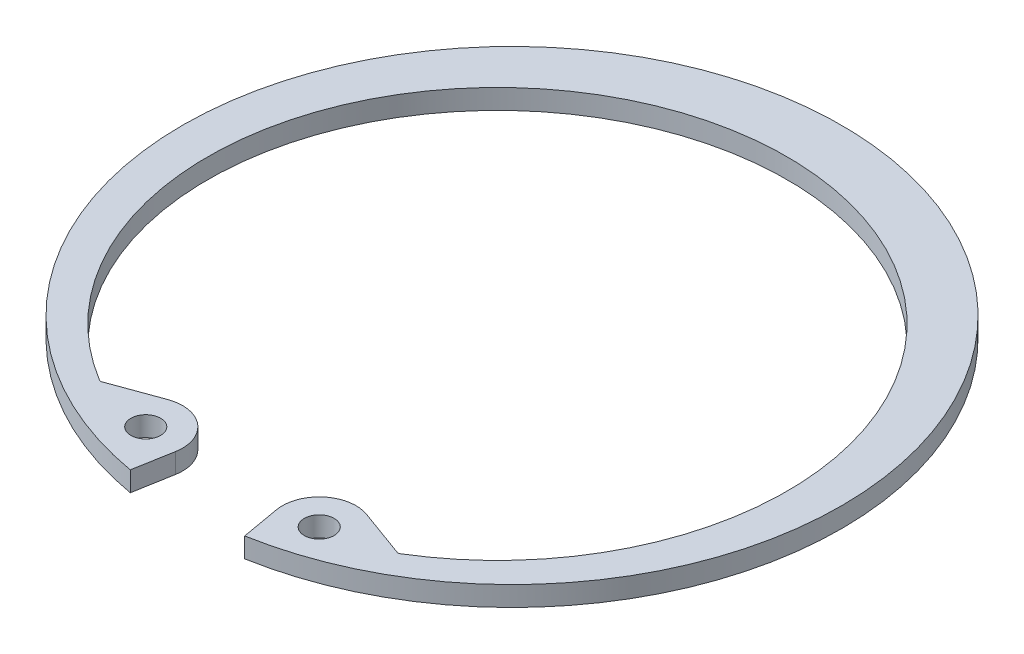
ISO-10303-21;
HEADER;
FILE_DESCRIPTION(('STEP AP214'),'2;1');
FILE_NAME('part.step','',(''),(''),'','','');
FILE_SCHEMA(('AUTOMOTIVE_DESIGN { 1 0 10303 214 1 1 1 1 }'));
ENDSEC;
DATA;
#1=APPLICATION_CONTEXT('core data for automotive mechanical design processes');
#2=APPLICATION_PROTOCOL_DEFINITION('international standard','automotive_design',2000,#1);
#3=PRODUCT_CONTEXT('',#1,'mechanical');
#4=PRODUCT('Part','Part','',(#3));
#5=PRODUCT_RELATED_PRODUCT_CATEGORY('part','',(#4));
#6=PRODUCT_DEFINITION_FORMATION('','',#4);
#7=PRODUCT_DEFINITION_CONTEXT('part definition',#1,'design');
#8=PRODUCT_DEFINITION('design','',#6,#7);
#9=PRODUCT_DEFINITION_SHAPE('','',#8);
#10=(LENGTH_UNIT() NAMED_UNIT(*) SI_UNIT(.MILLI.,.METRE.));
#11=(NAMED_UNIT(*) PLANE_ANGLE_UNIT() SI_UNIT($,.RADIAN.));
#12=(NAMED_UNIT(*) SI_UNIT($,.STERADIAN.) SOLID_ANGLE_UNIT());
#13=UNCERTAINTY_MEASURE_WITH_UNIT(LENGTH_MEASURE(1.E-05),#10,'distance_accuracy_value','');
#14=(GEOMETRIC_REPRESENTATION_CONTEXT(3) GLOBAL_UNCERTAINTY_ASSIGNED_CONTEXT((#13)) GLOBAL_UNIT_ASSIGNED_CONTEXT((#10,
#11,#12)) REPRESENTATION_CONTEXT('',''));
#15=CARTESIAN_POINT('',(0.,0.,0.));
#16=DIRECTION('',(0.,0.,1.));
#17=DIRECTION('',(1.,0.,0.));
#18=AXIS2_PLACEMENT_3D('',#15,#16,#17);
#19=CARTESIAN_POINT('',(6.87148699334858,-1.5748,22.1487706778557));
#20=DIRECTION('',(0.,1.,0.));
#21=DIRECTION('',(0.,0.,1.));
#22=AXIS2_PLACEMENT_3D('',#19,#20,#21);
#23=CYLINDRICAL_SURFACE('',#22,2.921);
#24=CARTESIAN_POINT('',(6.87148699334858,0.,22.1487706778557));
#25=DIRECTION('',(0.,1.,0.));
#26=DIRECTION('',(0.,0.,-1.));
#27=AXIS2_PLACEMENT_3D('',#24,#25,#26);
#28=CIRCLE('',#27,2.921);
#29=CARTESIAN_POINT('',(7.87052783200287,0.,19.4039285325401));
#30=VERTEX_POINT('',#29);
#31=CARTESIAN_POINT('',(3.99486354679992,0.,22.6559970048208));
#32=VERTEX_POINT('',#31);
#33=EDGE_CURVE('E207',#30,#32,#28,.T.);
#34=ORIENTED_EDGE('',*,*,#33,.F.);
#35=DIRECTION('',(0.,1.,0.));
#36=VECTOR('',#35,1.);
#37=CARTESIAN_POINT('',(7.87052783200287,-1.5748,19.4039285325401));
#38=LINE('',#37,#36);
#39=CARTESIAN_POINT('',(7.87052783200287,-1.5748,19.4039285325401));
#40=VERTEX_POINT('',#39);
#41=EDGE_CURVE('E175',#40,#30,#38,.T.);
#42=ORIENTED_EDGE('',*,*,#41,.F.);
#43=CARTESIAN_POINT('',(6.87148699334858,-1.5748,22.1487706778557));
#44=DIRECTION('',(0.,1.,0.));
#45=DIRECTION('',(0.,0.,-1.));
#46=AXIS2_PLACEMENT_3D('',#43,#44,#45);
#47=CIRCLE('',#46,2.921);
#48=CARTESIAN_POINT('',(3.99486354679992,-1.5748,22.6559970048208));
#49=VERTEX_POINT('',#48);
#50=EDGE_CURVE('E167',#40,#49,#47,.T.);
#51=ORIENTED_EDGE('',*,*,#50,.T.);
#52=DIRECTION('',(0.,1.,0.));
#53=VECTOR('',#52,1.);
#54=CARTESIAN_POINT('',(3.99486354679992,-1.5748,22.6559970048208));
#55=LINE('',#54,#53);
#56=EDGE_CURVE('E149',#49,#32,#55,.T.);
#57=ORIENTED_EDGE('',*,*,#56,.T.);
#58=EDGE_LOOP('',(#34,#42,#51,#57));
#59=FACE_BOUND('',#58,.T.);
#60=ADVANCED_FACE('F53',(#59),#23,.T.);
#61=CARTESIAN_POINT('',(11.8104832615939,-1.5748,20.8379550332467));
#62=DIRECTION('',(0.342020143325673,0.,-0.939692620785907));
#63=DIRECTION('',(-0.939692620785907,0.,-0.342020143325673));
#64=AXIS2_PLACEMENT_3D('',#61,#62,#63);
#65=PLANE('',#64);
#66=DIRECTION('',(-0.939692620785907,0.,-0.342020143325673));
#67=VECTOR('',#66,1.);
#68=CARTESIAN_POINT('',(11.8104832615939,0.,20.8379550332467));
#69=LINE('',#68,#67);
#70=CARTESIAN_POINT('',(11.6963266448967,0.,20.7964054227244));
#71=VERTEX_POINT('',#70);
#72=EDGE_CURVE('E177',#71,#30,#69,.T.);
#73=ORIENTED_EDGE('',*,*,#72,.F.);
#74=DIRECTION('',(0.,-1.,0.));
#75=VECTOR('',#74,1.);
#76=CARTESIAN_POINT('',(11.6963266448967,-1.5748,20.7964054227244));
#77=LINE('',#76,#75);
#78=CARTESIAN_POINT('',(11.6963266448967,-1.5748,20.7964054227244));
#79=VERTEX_POINT('',#78);
#80=EDGE_CURVE('E72',#71,#79,#77,.T.);
#81=ORIENTED_EDGE('',*,*,#80,.T.);
#82=DIRECTION('',(-0.939692620785907,0.,-0.342020143325673));
#83=VECTOR('',#82,1.);
#84=CARTESIAN_POINT('',(11.8104832615939,-1.5748,20.8379550332467));
#85=LINE('',#84,#83);
#86=EDGE_CURVE('E161',#79,#40,#85,.T.);
#87=ORIENTED_EDGE('',*,*,#86,.T.);
#88=ORIENTED_EDGE('',*,*,#41,.T.);
#89=EDGE_LOOP('',(#73,#81,#87,#88));
#90=FACE_BOUND('',#89,.T.);
#91=ADVANCED_FACE('F292',(#90),#65,.T.);
#92=CARTESIAN_POINT('',(0.,-1.5748,1.15835846487126));
#93=DIRECTION('',(0.,1.,0.));
#94=DIRECTION('',(0.,0.,1.));
#95=AXIS2_PLACEMENT_3D('',#92,#93,#94);
#96=CYLINDRICAL_SURFACE('',#95,22.9515584648713);
#97=CARTESIAN_POINT('',(0.,0.,1.15835846487126));
#98=DIRECTION('',(0.,-1.,0.));
#99=DIRECTION('',(0.,0.,1.));
#100=AXIS2_PLACEMENT_3D('',#97,#98,#99);
#101=CIRCLE('',#100,22.9515584648713);
#102=CARTESIAN_POINT('',(-11.9150612011123,0.,20.7748146315735));
#103=VERTEX_POINT('',#102);
#104=CARTESIAN_POINT('',(11.9150612011123,0.,20.7748146315736));
#105=VERTEX_POINT('',#104);
#106=EDGE_CURVE('E182',#103,#105,#101,.T.);
#107=ORIENTED_EDGE('',*,*,#106,.F.);
#108=DIRECTION('',(0.,1.,0.));
#109=VECTOR('',#108,1.);
#110=CARTESIAN_POINT('',(-11.9150612011123,-1.5748,20.7748146315735));
#111=LINE('',#110,#109);
#112=CARTESIAN_POINT('',(-11.9150612011123,-1.5748,20.7748146315735));
#113=VERTEX_POINT('',#112);
#114=EDGE_CURVE('E252',#103,#113,#111,.F.);
#115=ORIENTED_EDGE('',*,*,#114,.T.);
#116=CARTESIAN_POINT('',(0.,-1.5748,1.15835846487126));
#117=DIRECTION('',(0.,-1.,0.));
#118=DIRECTION('',(0.,0.,1.));
#119=AXIS2_PLACEMENT_3D('',#116,#117,#118);
#120=CIRCLE('',#119,22.9515584648713);
#121=CARTESIAN_POINT('',(11.9150612011123,-1.5748,20.7748146315736));
#122=VERTEX_POINT('',#121);
#123=EDGE_CURVE('E202',#113,#122,#120,.T.);
#124=ORIENTED_EDGE('',*,*,#123,.T.);
#125=DIRECTION('',(0.,1.,0.));
#126=VECTOR('',#125,1.);
#127=CARTESIAN_POINT('',(11.9150612011123,-1.5748,20.7748146315736));
#128=LINE('',#127,#126);
#129=EDGE_CURVE('E248',#122,#105,#128,.T.);
#130=ORIENTED_EDGE('',*,*,#129,.T.);
#131=EDGE_LOOP('',(#107,#115,#124,#130));
#132=FACE_BOUND('',#131,.T.);
#133=ADVANCED_FACE('F299',(#132),#96,.F.);
#134=CARTESIAN_POINT('',(-11.8104832615939,-1.5748,20.8379550332467));
#135=DIRECTION('',(-0.342020143325667,0.,-0.939692620785909));
#136=DIRECTION('',(-0.939692620785909,0.,0.342020143325667));
#137=AXIS2_PLACEMENT_3D('',#134,#135,#136);
#138=PLANE('',#137);
#139=DIRECTION('',(-0.939692620785909,0.,0.342020143325667));
#140=VECTOR('',#139,1.);
#141=CARTESIAN_POINT('',(-11.8104832615939,-1.5748,20.8379550332467));
#142=LINE('',#141,#140);
#143=CARTESIAN_POINT('',(-7.87052783200285,-1.5748,19.4039285325401));
#144=VERTEX_POINT('',#143);
#145=CARTESIAN_POINT('',(-11.6963266448966,-1.5748,20.7964054227244));
#146=VERTEX_POINT('',#145);
#147=EDGE_CURVE('E198',#144,#146,#142,.T.);
#148=ORIENTED_EDGE('',*,*,#147,.T.);
#149=DIRECTION('',(0.,-1.,0.));
#150=VECTOR('',#149,1.);
#151=CARTESIAN_POINT('',(-11.6963266448966,0.,20.7964054227244));
#152=LINE('',#151,#150);
#153=CARTESIAN_POINT('',(-11.6963266448966,0.,20.7964054227244));
#154=VERTEX_POINT('',#153);
#155=EDGE_CURVE('E233',#146,#154,#152,.F.);
#156=ORIENTED_EDGE('',*,*,#155,.T.);
#157=DIRECTION('',(-0.939692620785909,0.,0.342020143325667));
#158=VECTOR('',#157,1.);
#159=CARTESIAN_POINT('',(-11.8104832615939,0.,20.8379550332467));
#160=LINE('',#159,#158);
#161=CARTESIAN_POINT('',(-7.87052783200285,0.,19.4039285325401));
#162=VERTEX_POINT('',#161);
#163=EDGE_CURVE('E225',#162,#154,#160,.T.);
#164=ORIENTED_EDGE('',*,*,#163,.F.);
#165=DIRECTION('',(0.,1.,0.));
#166=VECTOR('',#165,1.);
#167=CARTESIAN_POINT('',(-7.87052783200285,-1.5748,19.4039285325401));
#168=LINE('',#167,#166);
#169=EDGE_CURVE('E234',#144,#162,#168,.T.);
#170=ORIENTED_EDGE('',*,*,#169,.F.);
#171=EDGE_LOOP('',(#148,#156,#164,#170));
#172=FACE_BOUND('',#171,.T.);
#173=ADVANCED_FACE('F306',(#172),#138,.T.);
#174=CARTESIAN_POINT('',(-6.87148699334858,-1.5748,22.1487706778557));
#175=DIRECTION('',(0.,1.,0.));
#176=DIRECTION('',(0.,0.,1.));
#177=AXIS2_PLACEMENT_3D('',#174,#175,#176);
#178=CYLINDRICAL_SURFACE('',#177,2.921);
#179=CARTESIAN_POINT('',(-6.87148699334858,0.,22.1487706778557));
#180=DIRECTION('',(0.,1.,0.));
#181=DIRECTION('',(0.,0.,1.));
#182=AXIS2_PLACEMENT_3D('',#179,#180,#181);
#183=CIRCLE('',#182,2.921);
#184=CARTESIAN_POINT('',(-3.99486354679992,0.,22.6559970048208));
#185=VERTEX_POINT('',#184);
#186=EDGE_CURVE('E221',#185,#162,#183,.T.);
#187=ORIENTED_EDGE('',*,*,#186,.F.);
#188=DIRECTION('',(0.,1.,0.));
#189=VECTOR('',#188,1.);
#190=CARTESIAN_POINT('',(-3.99486354679992,-1.5748,22.6559970048208));
#191=LINE('',#190,#189);
#192=CARTESIAN_POINT('',(-3.99486354679992,-1.5748,22.6559970048208));
#193=VERTEX_POINT('',#192);
#194=EDGE_CURVE('E237',#193,#185,#191,.T.);
#195=ORIENTED_EDGE('',*,*,#194,.F.);
#196=CARTESIAN_POINT('',(-6.87148699334858,-1.5748,22.1487706778557));
#197=DIRECTION('',(0.,1.,0.));
#198=DIRECTION('',(0.,0.,1.));
#199=AXIS2_PLACEMENT_3D('',#196,#197,#198);
#200=CIRCLE('',#199,2.921);
#201=EDGE_CURVE('E194',#193,#144,#200,.T.);
#202=ORIENTED_EDGE('',*,*,#201,.T.);
#203=ORIENTED_EDGE('',*,*,#169,.T.);
#204=EDGE_LOOP('',(#187,#195,#202,#203));
#205=FACE_BOUND('',#204,.T.);
#206=ADVANCED_FACE('F311',(#205),#178,.T.);
#207=CARTESIAN_POINT('',(-4.53416229669657,-1.5748,25.7145122004524));
#208=DIRECTION('',(0.984807753012209,0.,0.173648177666924));
#209=DIRECTION('',(0.173648177666924,0.,-0.984807753012209));
#210=AXIS2_PLACEMENT_3D('',#207,#208,#209);
#211=PLANE('',#210);
#212=DIRECTION('',(0.173648177666924,0.,-0.984807753012209));
#213=VECTOR('',#212,1.);
#214=CARTESIAN_POINT('',(-4.53416229669657,0.,25.7145122004524));
#215=LINE('',#214,#213);
#216=CARTESIAN_POINT('',(-4.53416229669657,0.,25.7145122004524));
#217=VERTEX_POINT('',#216);
#218=EDGE_CURVE('E217',#217,#185,#215,.T.);
#219=ORIENTED_EDGE('',*,*,#218,.F.);
#220=DIRECTION('',(0.,1.,0.));
#221=VECTOR('',#220,1.);
#222=CARTESIAN_POINT('',(-4.53416229669657,-1.5748,25.7145122004524));
#223=LINE('',#222,#221);
#224=CARTESIAN_POINT('',(-4.53416229669657,-1.5748,25.7145122004524));
#225=VERTEX_POINT('',#224);
#226=EDGE_CURVE('E240',#225,#217,#223,.T.);
#227=ORIENTED_EDGE('',*,*,#226,.F.);
#228=DIRECTION('',(0.173648177666924,0.,-0.984807753012209));
#229=VECTOR('',#228,1.);
#230=CARTESIAN_POINT('',(-4.53416229669657,-1.5748,25.7145122004524));
#231=LINE('',#230,#229);
#232=EDGE_CURVE('E190',#225,#193,#231,.T.);
#233=ORIENTED_EDGE('',*,*,#232,.T.);
#234=ORIENTED_EDGE('',*,*,#194,.T.);
#235=EDGE_LOOP('',(#219,#227,#233,#234));
#236=FACE_BOUND('',#235,.T.);
#237=ADVANCED_FACE('F314',(#236),#211,.T.);
#238=CARTESIAN_POINT('',(0.,-1.5748,0.));
#239=DIRECTION('',(0.,1.,0.));
#240=DIRECTION('',(0.,0.,1.));
#241=AXIS2_PLACEMENT_3D('',#238,#239,#240);
#242=CYLINDRICAL_SURFACE('',#241,26.1112);
#243=CARTESIAN_POINT('',(0.,0.,0.));
#244=DIRECTION('',(0.,1.,0.));
#245=DIRECTION('',(0.,0.,1.));
#246=AXIS2_PLACEMENT_3D('',#243,#244,#245);
#247=CIRCLE('',#246,26.1112);
#248=CARTESIAN_POINT('',(4.53416229669657,0.,25.7145122004524));
#249=VERTEX_POINT('',#248);
#250=EDGE_CURVE('E213',#249,#217,#247,.T.);
#251=ORIENTED_EDGE('',*,*,#250,.F.);
#252=DIRECTION('',(0.,1.,0.));
#253=VECTOR('',#252,1.);
#254=CARTESIAN_POINT('',(4.53416229669657,-1.5748,25.7145122004524));
#255=LINE('',#254,#253);
#256=CARTESIAN_POINT('',(4.53416229669657,-1.5748,25.7145122004524));
#257=VERTEX_POINT('',#256);
#258=EDGE_CURVE('E160',#257,#249,#255,.T.);
#259=ORIENTED_EDGE('',*,*,#258,.F.);
#260=CARTESIAN_POINT('',(0.,-1.5748,0.));
#261=DIRECTION('',(0.,1.,0.));
#262=DIRECTION('',(0.,0.,1.));
#263=AXIS2_PLACEMENT_3D('',#260,#261,#262);
#264=CIRCLE('',#263,26.1112);
#265=EDGE_CURVE('E170',#257,#225,#264,.T.);
#266=ORIENTED_EDGE('',*,*,#265,.T.);
#267=ORIENTED_EDGE('',*,*,#226,.T.);
#268=EDGE_LOOP('',(#251,#259,#266,#267));
#269=FACE_BOUND('',#268,.T.);
#270=ADVANCED_FACE('F317',(#269),#242,.T.);
#271=CARTESIAN_POINT('',(4.53416229669657,-1.5748,25.7145122004524));
#272=DIRECTION('',(-0.984807753012209,0.,0.173648177666924));
#273=DIRECTION('',(0.173648177666924,0.,0.984807753012209));
#274=AXIS2_PLACEMENT_3D('',#271,#272,#273);
#275=PLANE('',#274);
#276=DIRECTION('',(0.173648177666924,0.,0.984807753012209));
#277=VECTOR('',#276,1.);
#278=CARTESIAN_POINT('',(4.53416229669657,0.,25.7145122004524));
#279=LINE('',#278,#277);
#280=EDGE_CURVE('E154',#32,#249,#279,.T.);
#281=ORIENTED_EDGE('',*,*,#280,.F.);
#282=ORIENTED_EDGE('',*,*,#56,.F.);
#283=DIRECTION('',(0.173648177666924,0.,0.984807753012209));
#284=VECTOR('',#283,1.);
#285=CARTESIAN_POINT('',(4.53416229669657,-1.5748,25.7145122004524));
#286=LINE('',#285,#284);
#287=EDGE_CURVE('E152',#49,#257,#286,.T.);
#288=ORIENTED_EDGE('',*,*,#287,.T.);
#289=ORIENTED_EDGE('',*,*,#258,.T.);
#290=EDGE_LOOP('',(#281,#282,#288,#289));
#291=FACE_BOUND('',#290,.T.);
#292=ADVANCED_FACE('F151',(#291),#275,.T.);
#293=CARTESIAN_POINT('',(6.87148699334858,-1.5748,22.1487706778557));
#294=DIRECTION('',(0.,-1.,0.));
#295=DIRECTION('',(0.,0.,-1.));
#296=AXIS2_PLACEMENT_3D('',#293,#294,#295);
#297=PLANE('',#296);
#298=CARTESIAN_POINT('',(-6.87148699334858,-1.5748,22.1487706778557));
#299=DIRECTION('',(0.,1.,0.));
#300=DIRECTION('',(0.,0.,1.));
#301=AXIS2_PLACEMENT_3D('',#298,#299,#300);
#302=CIRCLE('',#301,1.1811);
#303=CARTESIAN_POINT('',(-6.87148699334858,-1.5748,23.3298706778557));
#304=VERTEX_POINT('',#303);
#305=EDGE_CURVE('E265',#304,#304,#302,.T.);
#306=ORIENTED_EDGE('',*,*,#305,.T.);
#307=EDGE_LOOP('',(#306));
#308=FACE_BOUND('',#307,.T.);
#309=CARTESIAN_POINT('',(6.87148699334858,-1.5748,22.1487706778557));
#310=DIRECTION('',(0.,1.,0.));
#311=DIRECTION('',(0.,0.,1.));
#312=AXIS2_PLACEMENT_3D('',#309,#310,#311);
#313=CIRCLE('',#312,1.1811);
#314=CARTESIAN_POINT('',(6.87148699334858,-1.5748,23.3298706778557));
#315=VERTEX_POINT('',#314);
#316=EDGE_CURVE('E210',#315,#315,#313,.T.);
#317=ORIENTED_EDGE('',*,*,#316,.T.);
#318=EDGE_LOOP('',(#317));
#319=FACE_BOUND('',#318,.T.);
#320=ORIENTED_EDGE('',*,*,#50,.F.);
#321=ORIENTED_EDGE('',*,*,#86,.F.);
#322=CARTESIAN_POINT('',(11.7831997613014,-1.5748,20.5577234970448));
#323=DIRECTION('',(0.,-1.,0.));
#324=DIRECTION('',(0.,0.,-1.));
#325=AXIS2_PLACEMENT_3D('',#322,#323,#324);
#326=CIRCLE('',#325,0.254);
#327=EDGE_CURVE('E11',#79,#122,#326,.F.);
#328=ORIENTED_EDGE('',*,*,#327,.T.);
#329=ORIENTED_EDGE('',*,*,#123,.F.);
#330=CARTESIAN_POINT('',(-11.7831997613014,-1.5748,20.5577234970448));
#331=DIRECTION('',(0.,-1.,0.));
#332=DIRECTION('',(0.,0.,-1.));
#333=AXIS2_PLACEMENT_3D('',#330,#331,#332);
#334=CIRCLE('',#333,0.254);
#335=EDGE_CURVE('E260',#113,#146,#334,.F.);
#336=ORIENTED_EDGE('',*,*,#335,.T.);
#337=ORIENTED_EDGE('',*,*,#147,.F.);
#338=ORIENTED_EDGE('',*,*,#201,.F.);
#339=ORIENTED_EDGE('',*,*,#232,.F.);
#340=ORIENTED_EDGE('',*,*,#265,.F.);
#341=ORIENTED_EDGE('',*,*,#287,.F.);
#342=EDGE_LOOP('',(#320,#321,#328,#329,#336,#337,#338,#339,#340,#341));
#343=FACE_BOUND('',#342,.T.);
#344=ADVANCED_FACE('F166',(#308,#319,#343),#297,.T.);
#345=CARTESIAN_POINT('',(6.87148699334858,0.,22.1487706778557));
#346=DIRECTION('',(0.,-1.,0.));
#347=DIRECTION('',(0.,0.,-1.));
#348=AXIS2_PLACEMENT_3D('',#345,#346,#347);
#349=PLANE('',#348);
#350=CARTESIAN_POINT('',(-6.87148699334858,0.,22.1487706778557));
#351=DIRECTION('',(0.,1.,0.));
#352=DIRECTION('',(0.,0.,1.));
#353=AXIS2_PLACEMENT_3D('',#350,#351,#352);
#354=CIRCLE('',#353,1.1811);
#355=CARTESIAN_POINT('',(-6.87148699334858,0.,23.3298706778557));
#356=VERTEX_POINT('',#355);
#357=EDGE_CURVE('E267',#356,#356,#354,.T.);
#358=ORIENTED_EDGE('',*,*,#357,.F.);
#359=EDGE_LOOP('',(#358));
#360=FACE_BOUND('',#359,.T.);
#361=CARTESIAN_POINT('',(6.87148699334858,0.,22.1487706778557));
#362=DIRECTION('',(0.,1.,0.));
#363=DIRECTION('',(0.,0.,1.));
#364=AXIS2_PLACEMENT_3D('',#361,#362,#363);
#365=CIRCLE('',#364,1.1811);
#366=CARTESIAN_POINT('',(6.87148699334858,0.,23.3298706778557));
#367=VERTEX_POINT('',#366);
#368=EDGE_CURVE('E185',#367,#367,#365,.T.);
#369=ORIENTED_EDGE('',*,*,#368,.F.);
#370=EDGE_LOOP('',(#369));
#371=FACE_BOUND('',#370,.T.);
#372=ORIENTED_EDGE('',*,*,#33,.T.);
#373=ORIENTED_EDGE('',*,*,#280,.T.);
#374=ORIENTED_EDGE('',*,*,#250,.T.);
#375=ORIENTED_EDGE('',*,*,#218,.T.);
#376=ORIENTED_EDGE('',*,*,#186,.T.);
#377=ORIENTED_EDGE('',*,*,#163,.T.);
#378=CARTESIAN_POINT('',(-11.7831997613014,0.,20.5577234970448));
#379=DIRECTION('',(0.,-1.,0.));
#380=DIRECTION('',(0.,0.,-1.));
#381=AXIS2_PLACEMENT_3D('',#378,#379,#380);
#382=CIRCLE('',#381,0.254);
#383=EDGE_CURVE('E257',#154,#103,#382,.T.);
#384=ORIENTED_EDGE('',*,*,#383,.T.);
#385=ORIENTED_EDGE('',*,*,#106,.T.);
#386=CARTESIAN_POINT('',(11.7831997613014,0.,20.5577234970448));
#387=DIRECTION('',(0.,-1.,0.));
#388=DIRECTION('',(0.,0.,-1.));
#389=AXIS2_PLACEMENT_3D('',#386,#387,#388);
#390=CIRCLE('',#389,0.254);
#391=EDGE_CURVE('E62',#105,#71,#390,.T.);
#392=ORIENTED_EDGE('',*,*,#391,.T.);
#393=ORIENTED_EDGE('',*,*,#72,.T.);
#394=EDGE_LOOP('',(#372,#373,#374,#375,#376,#377,#384,#385,#392,#393));
#395=FACE_BOUND('',#394,.T.);
#396=ADVANCED_FACE('F287',(#360,#371,#395),#349,.F.);
#397=CARTESIAN_POINT('',(6.87148699334858,-1.5748,22.1487706778557));
#398=DIRECTION('',(0.,1.,0.));
#399=DIRECTION('',(0.,0.,1.));
#400=AXIS2_PLACEMENT_3D('',#397,#398,#399);
#401=CYLINDRICAL_SURFACE('',#400,1.1811);
#402=ORIENTED_EDGE('',*,*,#316,.F.);
#403=EDGE_LOOP('',(#402));
#404=FACE_BOUND('',#403,.T.);
#405=ORIENTED_EDGE('',*,*,#368,.T.);
#406=EDGE_LOOP('',(#405));
#407=FACE_BOUND('',#406,.T.);
#408=ADVANCED_FACE('F283',(#404,#407),#401,.F.);
#409=CARTESIAN_POINT('',(-6.87148699334858,-1.5748,22.1487706778557));
#410=DIRECTION('',(0.,1.,0.));
#411=DIRECTION('',(0.,0.,1.));
#412=AXIS2_PLACEMENT_3D('',#409,#410,#411);
#413=CYLINDRICAL_SURFACE('',#412,1.1811);
#414=ORIENTED_EDGE('',*,*,#305,.F.);
#415=EDGE_LOOP('',(#414));
#416=FACE_BOUND('',#415,.T.);
#417=ORIENTED_EDGE('',*,*,#357,.T.);
#418=EDGE_LOOP('',(#417));
#419=FACE_BOUND('',#418,.T.);
#420=ADVANCED_FACE('F279',(#416,#419),#413,.F.);
#421=CARTESIAN_POINT('',(-11.7831997613014,-1.5748,20.5577234970448));
#422=DIRECTION('',(0.,1.,0.));
#423=DIRECTION('',(0.,0.,1.));
#424=AXIS2_PLACEMENT_3D('',#421,#422,#423);
#425=CYLINDRICAL_SURFACE('',#424,0.254);
#426=ORIENTED_EDGE('',*,*,#335,.F.);
#427=ORIENTED_EDGE('',*,*,#114,.F.);
#428=ORIENTED_EDGE('',*,*,#383,.F.);
#429=ORIENTED_EDGE('',*,*,#155,.F.);
#430=EDGE_LOOP('',(#426,#427,#428,#429));
#431=FACE_BOUND('',#430,.T.);
#432=ADVANCED_FACE('F282',(#431),#425,.F.);
#433=CARTESIAN_POINT('',(11.7831997613014,-1.5748,20.5577234970448));
#434=DIRECTION('',(0.,1.,0.));
#435=DIRECTION('',(0.,0.,1.));
#436=AXIS2_PLACEMENT_3D('',#433,#434,#435);
#437=CYLINDRICAL_SURFACE('',#436,0.254);
#438=ORIENTED_EDGE('',*,*,#327,.F.);
#439=ORIENTED_EDGE('',*,*,#80,.F.);
#440=ORIENTED_EDGE('',*,*,#391,.F.);
#441=ORIENTED_EDGE('',*,*,#129,.F.);
#442=EDGE_LOOP('',(#438,#439,#440,#441));
#443=FACE_BOUND('',#442,.T.);
#444=ADVANCED_FACE('F55',(#443),#437,.F.);
#445=CLOSED_SHELL('',(#60,#91,#133,#173,#206,#237,#270,#292,#344,#396,#408,#420,#432,#444));
#446=MANIFOLD_SOLID_BREP('B2',#445);
#447=ADVANCED_BREP_SHAPE_REPRESENTATION('',(#18,#446),#14);
#448=SHAPE_DEFINITION_REPRESENTATION(#9,#447);
ENDSEC;
END-ISO-10303-21;
